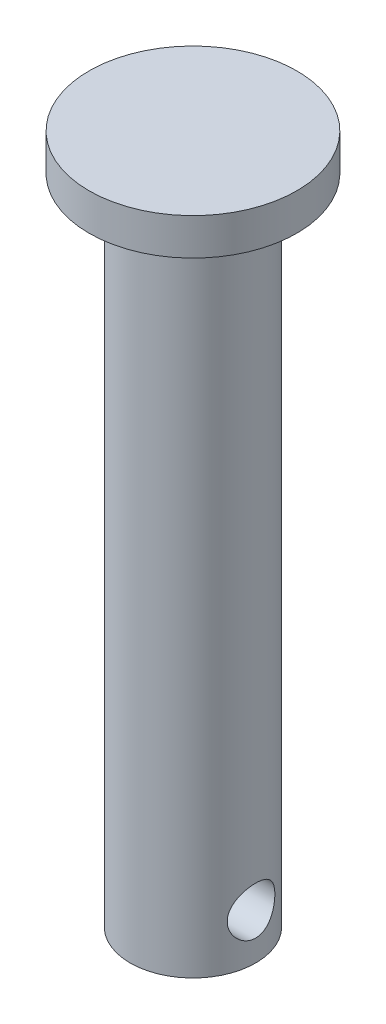
ISO-10303-21;
HEADER;
FILE_DESCRIPTION(('STEP AP214'),'2;1');
FILE_NAME('part.step','',(''),(''),'','','');
FILE_SCHEMA(('AUTOMOTIVE_DESIGN { 1 0 10303 214 1 1 1 1 }'));
ENDSEC;
DATA;
#1=APPLICATION_CONTEXT('core data for automotive mechanical design processes');
#2=APPLICATION_PROTOCOL_DEFINITION('international standard','automotive_design',2000,#1);
#3=PRODUCT_CONTEXT('',#1,'mechanical');
#4=PRODUCT('Part','Part','',(#3));
#5=PRODUCT_RELATED_PRODUCT_CATEGORY('part','',(#4));
#6=PRODUCT_DEFINITION_FORMATION('','',#4);
#7=PRODUCT_DEFINITION_CONTEXT('part definition',#1,'design');
#8=PRODUCT_DEFINITION('design','',#6,#7);
#9=PRODUCT_DEFINITION_SHAPE('','',#8);
#10=(LENGTH_UNIT() NAMED_UNIT(*) SI_UNIT(.MILLI.,.METRE.));
#11=(NAMED_UNIT(*) PLANE_ANGLE_UNIT() SI_UNIT($,.RADIAN.));
#12=(NAMED_UNIT(*) SI_UNIT($,.STERADIAN.) SOLID_ANGLE_UNIT());
#13=UNCERTAINTY_MEASURE_WITH_UNIT(LENGTH_MEASURE(1.E-05),#10,'distance_accuracy_value','');
#14=(GEOMETRIC_REPRESENTATION_CONTEXT(3) GLOBAL_UNCERTAINTY_ASSIGNED_CONTEXT((#13)) GLOBAL_UNIT_ASSIGNED_CONTEXT((#10,
#11,#12)) REPRESENTATION_CONTEXT('',''));
#15=CARTESIAN_POINT('',(0.,0.,0.));
#16=DIRECTION('',(0.,0.,1.));
#17=DIRECTION('',(1.,0.,0.));
#18=AXIS2_PLACEMENT_3D('',#15,#16,#17);
#19=CARTESIAN_POINT('',(0.,-30.15,0.));
#20=DIRECTION('',(0.,1.,0.));
#21=DIRECTION('',(0.,0.,1.));
#22=AXIS2_PLACEMENT_3D('',#19,#20,#21);
#23=CYLINDRICAL_SURFACE('',#22,2.9);
#24=CARTESIAN_POINT('',(-2.68328157299975,-28.05,-1.1));
#25=CARTESIAN_POINT('',(-2.68327922428061,-28.1093489957827,-1.10000248458652));
#26=CARTESIAN_POINT('',(-2.68527194816873,-28.1686818478587,-1.09518093454106));
#27=CARTESIAN_POINT('',(-2.69296977625882,-28.2855554067235,-1.07611268162352));
#28=CARTESIAN_POINT('',(-2.69867470301504,-28.3430961990362,-1.06186642925785));
#29=CARTESIAN_POINT('',(-2.71305970150571,-28.4546639656839,-1.02454933942359));
#30=CARTESIAN_POINT('',(-2.72173249092959,-28.5086991593079,-1.00150008615598));
#31=CARTESIAN_POINT('',(-2.74106414626587,-28.612156903674,-0.947307985473208));
#32=CARTESIAN_POINT('',(-2.75172362287233,-28.661578029053,-0.916162648211992));
#33=CARTESIAN_POINT('',(-2.77443512570219,-28.7569192849796,-0.844965414548746));
#34=CARTESIAN_POINT('',(-2.78652876390518,-28.8025716237422,-0.804568095265991));
#35=CARTESIAN_POINT('',(-2.81039925445747,-28.8866430388596,-0.716746059198641));
#36=CARTESIAN_POINT('',(-2.82217603672252,-28.9250605260548,-0.669319802562992));
#37=CARTESIAN_POINT('',(-2.84458196401774,-28.9948701560771,-0.566745202086737));
#38=CARTESIAN_POINT('',(-2.85515665634353,-29.0259700459012,-0.511384997850494));
#39=CARTESIAN_POINT('',(-2.87346559490726,-29.0783036116571,-0.395746254146733));
#40=CARTESIAN_POINT('',(-2.88120085063207,-29.0995407947278,-0.335469471972143));
#41=CARTESIAN_POINT('',(-2.89266387119534,-29.1306033835331,-0.214524787227563));
#42=CARTESIAN_POINT('',(-2.89655309068144,-29.1408900805804,-0.153990961935245));
#43=CARTESIAN_POINT('',(-2.90046595516458,-29.1512389796451,-0.031939630583864));
#44=CARTESIAN_POINT('',(-2.9004908861957,-29.1513045832395,0.029577541401328));
#45=CARTESIAN_POINT('',(-2.89677431077073,-29.1414754067378,0.14853825001169));
#46=CARTESIAN_POINT('',(-2.89322331838582,-29.1320844439505,0.2060304086711));
#47=CARTESIAN_POINT('',(-2.88300492931398,-29.1044578020864,0.318552502837979));
#48=CARTESIAN_POINT('',(-2.87633731139644,-29.0862214951281,0.373582263250618));
#49=CARTESIAN_POINT('',(-2.86042254178452,-29.0411940177408,0.480576439062401));
#50=CARTESIAN_POINT('',(-2.85113900511872,-29.0142813456148,0.532484085861092));
#51=CARTESIAN_POINT('',(-2.83092877962131,-28.9527736373333,0.63117638536569));
#52=CARTESIAN_POINT('',(-2.82000155459727,-28.9181760925109,0.677959357697908));
#53=CARTESIAN_POINT('',(-2.79685697398916,-28.839866195459,0.768037767468278));
#54=CARTESIAN_POINT('',(-2.7846015436762,-28.795732846916,0.810957985207524));
#55=CARTESIAN_POINT('',(-2.76070055852013,-28.7008255667262,0.88893159880426));
#56=CARTESIAN_POINT('',(-2.74905516483828,-28.6500498925572,0.92398292379018));
#57=CARTESIAN_POINT('',(-2.72744956768312,-28.5417858459963,0.985963844451359));
#58=CARTESIAN_POINT('',(-2.71753465419085,-28.4841692143271,1.01268647609242));
#59=CARTESIAN_POINT('',(-2.70103732259648,-28.3647782244557,1.05590670284941));
#60=CARTESIAN_POINT('',(-2.69445299882884,-28.3030062667863,1.07241014629886));
#61=CARTESIAN_POINT('',(-2.68581406995569,-28.18077260692,1.09386005815007));
#62=CARTESIAN_POINT('',(-2.68352566239426,-28.1204324136924,1.0994039762716));
#63=CARTESIAN_POINT('',(-2.68307507283055,-27.9996537282618,1.10050432818759));
#64=CARTESIAN_POINT('',(-2.68491182496839,-27.9392152654818,1.09606334188405));
#65=CARTESIAN_POINT('',(-2.69226671824544,-27.8230618758687,1.07786206129302));
#66=CARTESIAN_POINT('',(-2.69760001004972,-27.7672606244478,1.06456920532543));
#67=CARTESIAN_POINT('',(-2.7111261186948,-27.6587079715532,1.02963271118627));
#68=CARTESIAN_POINT('',(-2.71931952954047,-27.6059572062758,1.00798733822056));
#69=CARTESIAN_POINT('',(-2.73802573291347,-27.5027702792883,0.956034940410264));
#70=CARTESIAN_POINT('',(-2.74861489819177,-27.4524984964488,0.925429749414474));
#71=CARTESIAN_POINT('',(-2.77079316727057,-27.3575924384407,0.856741568259134));
#72=CARTESIAN_POINT('',(-2.78238264338846,-27.3129602777112,0.818655787024471));
#73=CARTESIAN_POINT('',(-2.80616770118132,-27.2275840747558,0.733153611019962));
#74=CARTESIAN_POINT('',(-2.81835359950513,-27.1872825638096,0.685291082628647));
#75=CARTESIAN_POINT('',(-2.84123732375253,-27.1152276813709,0.583184609426029));
#76=CARTESIAN_POINT('',(-2.85193513643075,-27.0834743859632,0.528940607821527));
#77=CARTESIAN_POINT('',(-2.87063616892688,-27.0296128482981,0.415610983343923));
#78=CARTESIAN_POINT('',(-2.87864733308523,-27.0074761117823,0.356540288773049));
#79=CARTESIAN_POINT('',(-2.89109401464001,-26.9735818843982,0.235139344795649));
#80=CARTESIAN_POINT('',(-2.89553125612603,-26.9618193886506,0.172810682531761));
#81=CARTESIAN_POINT('',(-2.90016328731524,-26.9495564895614,0.050658318150835));
#82=CARTESIAN_POINT('',(-2.90059470016221,-26.9484278829323,-0.00909389404199003));
#83=CARTESIAN_POINT('',(-2.89778717379496,-26.9558416335808,-0.127901157559073));
#84=CARTESIAN_POINT('',(-2.89454869471531,-26.9643827784555,-0.18695629534524));
#85=CARTESIAN_POINT('',(-2.8848750389771,-26.9904508157464,-0.301165868643171));
#86=CARTESIAN_POINT('',(-2.87852321046742,-27.0077437840756,-0.356381298759012));
#87=CARTESIAN_POINT('',(-2.86328858759242,-27.0505895625212,-0.463129089883909));
#88=CARTESIAN_POINT('',(-2.85440531389639,-27.0761439370635,-0.514660751055327));
#89=CARTESIAN_POINT('',(-2.83452467507603,-27.1360198175127,-0.614976465542052));
#90=CARTESIAN_POINT('',(-2.82345355361749,-27.1706675401821,-0.663550913575489));
#91=CARTESIAN_POINT('',(-2.80055278756133,-27.2472363494234,-0.754388675138865));
#92=CARTESIAN_POINT('',(-2.78872287075173,-27.2891600555027,-0.796649705473975));
#93=CARTESIAN_POINT('',(-2.76484922874998,-27.3817954218275,-0.876025383679001));
#94=CARTESIAN_POINT('',(-2.75282876859055,-27.4328606343524,-0.912736027336448));
#95=CARTESIAN_POINT('',(-2.73065635649221,-27.5408138736477,-0.977076367086537));
#96=CARTESIAN_POINT('',(-2.7205046828706,-27.5977027657753,-1.00470471103813));
#97=CARTESIAN_POINT('',(-2.70291934803477,-27.7190113021179,-1.05113434765141));
#98=CARTESIAN_POINT('',(-2.69566125827775,-27.7836714241292,-1.06938090340288));
#99=CARTESIAN_POINT('',(-2.68584535520345,-27.915562494293,-1.09380807528596));
#100=CARTESIAN_POINT('',(-2.68328423275257,-27.9827915984167,-1.0999971863873));
#101=CARTESIAN_POINT('',(-2.68328157299975,-28.05,-1.1));
#102=B_SPLINE_CURVE_WITH_KNOTS('',3,(#24,#25,#26,#27,#28,#29,#30,#31,#32,#33,#34,#35,#36,#37,
#38,#39,#40,#41,#42,#43,#44,#45,#46,#47,#48,#49,#50,#51,#52,#53,#54,#55,#56,#57,#58,#59,#60,#61,
#62,#63,#64,#65,#66,#67,#68,#69,#70,#71,#72,#73,#74,#75,#76,#77,#78,#79,#80,#81,#82,#83,#84,#85,
#86,#87,#88,#89,#90,#91,#92,#93,#94,#95,#96,#97,#98,#99,#100,#101),.UNSPECIFIED.,.T.,.F.,(4,2,2,
2,2,2,2,2,2,2,2,2,2,2,2,2,2,2,2,2,2,2,2,2,2,2,2,2,2,2,2,2,2,2,2,2,2,2,4),(0.,0.177796574464576,
0.355584650760326,0.532939575871951,0.710349108862263,0.895967258544038,1.08162613244064,
1.27376977172793,1.46584503309233,1.64946317987082,1.83302021845158,2.00728945781907,
2.18157106939744,2.35840779424604,2.53530233113083,2.72276283516801,2.91027261586172,
3.10212634980536,3.29387018616065,3.47483657897536,3.65575621902349,3.82780839632731,
3.99989632763184,4.1785304511878,4.35723135177682,4.54757053004695,4.73791140240686,
4.92768437491853,5.1173657444689,5.29576586204596,5.47414361411973,5.64798724425535,
5.821863813687,6.00312410764832,6.18444979501808,6.37562052515605,6.5668197032486,
6.76830333868922,6.96964496914397),.UNSPECIFIED.);
#103=CARTESIAN_POINT('',(-2.68328157299975,-28.05,-1.1));
#104=VERTEX_POINT('',#103);
#105=EDGE_CURVE('E47',#104,#104,#102,.T.);
#106=ORIENTED_EDGE('',*,*,#105,.F.);
#107=EDGE_LOOP('',(#106));
#108=FACE_BOUND('',#107,.T.);
#109=CARTESIAN_POINT('',(2.68328157299975,-28.05,-1.1));
#110=CARTESIAN_POINT('',(2.68327922428061,-27.9906510042173,-1.10000248458652));
#111=CARTESIAN_POINT('',(2.68527194816873,-27.9313181521413,-1.09518093454106));
#112=CARTESIAN_POINT('',(2.69296977625882,-27.8144445932765,-1.07611268162352));
#113=CARTESIAN_POINT('',(2.69867470301504,-27.7569038009638,-1.06186642925785));
#114=CARTESIAN_POINT('',(2.71305970150571,-27.6453360343161,-1.02454933942359));
#115=CARTESIAN_POINT('',(2.72173249092959,-27.5913008406921,-1.00150008615598));
#116=CARTESIAN_POINT('',(2.74106414626587,-27.487843096326,-0.947307985473208));
#117=CARTESIAN_POINT('',(2.75172362287233,-27.438421970947,-0.916162648211992));
#118=CARTESIAN_POINT('',(2.77443512570219,-27.3430807150204,-0.844965414548747));
#119=CARTESIAN_POINT('',(2.78652876390518,-27.2974283762578,-0.804568095265993));
#120=CARTESIAN_POINT('',(2.81039925445747,-27.2133569611404,-0.716746059198644));
#121=CARTESIAN_POINT('',(2.82217603672252,-27.1749394739452,-0.669319802562993));
#122=CARTESIAN_POINT('',(2.84458196401774,-27.1051298439229,-0.566745202086737));
#123=CARTESIAN_POINT('',(2.85515665634353,-27.0740299540988,-0.511384997850494));
#124=CARTESIAN_POINT('',(2.87346559490726,-27.0216963883429,-0.395746254146733));
#125=CARTESIAN_POINT('',(2.88120085063207,-27.0004592052722,-0.335469471972143));
#126=CARTESIAN_POINT('',(2.89266387119534,-26.9693966164669,-0.214524787227563));
#127=CARTESIAN_POINT('',(2.89655309068144,-26.9591099194196,-0.153990961935245));
#128=CARTESIAN_POINT('',(2.90046595516458,-26.9487610203549,-0.0319396305838634));
#129=CARTESIAN_POINT('',(2.9004908861957,-26.9486954167605,0.0295775414013283));
#130=CARTESIAN_POINT('',(2.89677431077073,-26.9585245932622,0.14853825001169));
#131=CARTESIAN_POINT('',(2.89322331838582,-26.9679155560495,0.2060304086711));
#132=CARTESIAN_POINT('',(2.88300492931398,-26.9955421979136,0.318552502837979));
#133=CARTESIAN_POINT('',(2.87633731139644,-27.0137785048719,0.373582263250618));
#134=CARTESIAN_POINT('',(2.86042254178452,-27.0588059822592,0.480576439062401));
#135=CARTESIAN_POINT('',(2.85113900511872,-27.0857186543852,0.532484085861092));
#136=CARTESIAN_POINT('',(2.83092877962131,-27.1472263626667,0.63117638536569));
#137=CARTESIAN_POINT('',(2.82000155459727,-27.1818239074891,0.677959357697908));
#138=CARTESIAN_POINT('',(2.79685697398916,-27.260133804541,0.768037767468278));
#139=CARTESIAN_POINT('',(2.7846015436762,-27.304267153084,0.810957985207524));
#140=CARTESIAN_POINT('',(2.76070055852013,-27.3991744332738,0.88893159880426));
#141=CARTESIAN_POINT('',(2.74905516483828,-27.4499501074428,0.92398292379018));
#142=CARTESIAN_POINT('',(2.72744956768312,-27.5582141540037,0.985963844451359));
#143=CARTESIAN_POINT('',(2.71753465419085,-27.6158307856729,1.01268647609242));
#144=CARTESIAN_POINT('',(2.70103732259648,-27.7352217755443,1.05590670284941));
#145=CARTESIAN_POINT('',(2.69445299882884,-27.7969937332137,1.07241014629886));
#146=CARTESIAN_POINT('',(2.68581406995569,-27.91922739308,1.09386005815007));
#147=CARTESIAN_POINT('',(2.68352566239426,-27.9795675863076,1.0994039762716));
#148=CARTESIAN_POINT('',(2.68307507283055,-28.1003462717382,1.10050432818759));
#149=CARTESIAN_POINT('',(2.68491182496839,-28.1607847345182,1.09606334188405));
#150=CARTESIAN_POINT('',(2.69226671824544,-28.2769381241313,1.07786206129302));
#151=CARTESIAN_POINT('',(2.69760001004972,-28.3327393755522,1.06456920532543));
#152=CARTESIAN_POINT('',(2.71112611869479,-28.4412920284468,1.02963271118627));
#153=CARTESIAN_POINT('',(2.71931952954047,-28.4940427937242,1.00798733822056));
#154=CARTESIAN_POINT('',(2.73802573291347,-28.5972297207117,0.956034940410264));
#155=CARTESIAN_POINT('',(2.74861489819177,-28.6475015035512,0.925429749414474));
#156=CARTESIAN_POINT('',(2.77079316727057,-28.7424075615593,0.856741568259134));
#157=CARTESIAN_POINT('',(2.78238264338846,-28.7870397222888,0.818655787024471));
#158=CARTESIAN_POINT('',(2.80616770118132,-28.8724159252442,0.733153611019962));
#159=CARTESIAN_POINT('',(2.81835359950513,-28.9127174361904,0.685291082628648));
#160=CARTESIAN_POINT('',(2.84123732375253,-28.9847723186291,0.58318460942603));
#161=CARTESIAN_POINT('',(2.85193513643075,-29.0165256140368,0.528940607821528));
#162=CARTESIAN_POINT('',(2.87063616892688,-29.0703871517019,0.415610983343922));
#163=CARTESIAN_POINT('',(2.87864733308523,-29.0925238882177,0.356540288773049));
#164=CARTESIAN_POINT('',(2.89109401464001,-29.1264181156018,0.235139344795648));
#165=CARTESIAN_POINT('',(2.89553125612603,-29.1381806113494,0.172810682531761));
#166=CARTESIAN_POINT('',(2.90016328731524,-29.1504435104386,0.0506583181508351));
#167=CARTESIAN_POINT('',(2.90059470016221,-29.1515721170677,-0.00909389404198984));
#168=CARTESIAN_POINT('',(2.89778717379496,-29.1441583664192,-0.127901157559073));
#169=CARTESIAN_POINT('',(2.89454869471531,-29.1356172215445,-0.18695629534524));
#170=CARTESIAN_POINT('',(2.8848750389771,-29.1095491842536,-0.30116586864317));
#171=CARTESIAN_POINT('',(2.87852321046742,-29.0922562159244,-0.35638129875901));
#172=CARTESIAN_POINT('',(2.86328858759242,-29.0494104374788,-0.463129089883907));
#173=CARTESIAN_POINT('',(2.85440531389639,-29.0238560629365,-0.514660751055326));
#174=CARTESIAN_POINT('',(2.83452467507603,-28.9639801824873,-0.614976465542052));
#175=CARTESIAN_POINT('',(2.82345355361749,-28.9293324598179,-0.663550913575489));
#176=CARTESIAN_POINT('',(2.80055278756133,-28.8527636505766,-0.754388675138865));
#177=CARTESIAN_POINT('',(2.78872287075173,-28.8108399444973,-0.796649705473975));
#178=CARTESIAN_POINT('',(2.76484922874998,-28.7182045781725,-0.876025383679001));
#179=CARTESIAN_POINT('',(2.75282876859055,-28.6671393656476,-0.912736027336448));
#180=CARTESIAN_POINT('',(2.73065635649221,-28.5591861263523,-0.977076367086537));
#181=CARTESIAN_POINT('',(2.7205046828706,-28.5022972342247,-1.00470471103813));
#182=CARTESIAN_POINT('',(2.70291934803477,-28.380988697882,-1.05113434765141));
#183=CARTESIAN_POINT('',(2.69566125827775,-28.3163285758708,-1.06938090340288));
#184=CARTESIAN_POINT('',(2.68584535520345,-28.184437505707,-1.09380807528596));
#185=CARTESIAN_POINT('',(2.68328423275257,-28.1172084015833,-1.0999971863873));
#186=CARTESIAN_POINT('',(2.68328157299975,-28.05,-1.1));
#187=B_SPLINE_CURVE_WITH_KNOTS('',3,(#109,#110,#111,#112,#113,#114,#115,#116,#117,#118,#119,
#120,#121,#122,#123,#124,#125,#126,#127,#128,#129,#130,#131,#132,#133,#134,#135,#136,#137,#138,
#139,#140,#141,#142,#143,#144,#145,#146,#147,#148,#149,#150,#151,#152,#153,#154,#155,#156,#157,
#158,#159,#160,#161,#162,#163,#164,#165,#166,#167,#168,#169,#170,#171,#172,#173,#174,#175,#176,
#177,#178,#179,#180,#181,#182,#183,#184,#185,#186),.UNSPECIFIED.,.T.,.F.,(4,2,2,2,2,2,2,2,2,2,2,
2,2,2,2,2,2,2,2,2,2,2,2,2,2,2,2,2,2,2,2,2,2,2,2,2,2,2,4),(0.,0.177796574464576,
0.355584650760326,0.532939575871951,0.710349108862263,0.895967258544033,1.08162613244064,
1.27376977172793,1.46584503309233,1.64946317987082,1.83302021845158,2.00728945781907,
2.18157106939744,2.35840779424604,2.53530233113083,2.72276283516801,2.91027261586172,
3.10212634980536,3.29387018616065,3.47483657897536,3.65575621902349,3.82780839632731,
3.99989632763184,4.1785304511878,4.35723135177682,4.54757053004695,4.73791140240686,
4.92768437491853,5.1173657444689,5.29576586204596,5.47414361411973,5.64798724425534,
5.821863813687,6.00312410764832,6.18444979501808,6.37562052515605,6.5668197032486,
6.76830333868922,6.96964496914397),.UNSPECIFIED.);
#188=CARTESIAN_POINT('',(2.68328157299975,-28.05,-1.1));
#189=VERTEX_POINT('',#188);
#190=EDGE_CURVE('E65',#189,#189,#187,.T.);
#191=ORIENTED_EDGE('',*,*,#190,.F.);
#192=EDGE_LOOP('',(#191));
#193=FACE_BOUND('',#192,.T.);
#194=CARTESIAN_POINT('',(0.,-30.15,0.));
#195=DIRECTION('',(0.,1.,0.));
#196=DIRECTION('',(0.,0.,1.));
#197=AXIS2_PLACEMENT_3D('',#194,#195,#196);
#198=CIRCLE('',#197,2.9);
#199=CARTESIAN_POINT('',(0.,-30.15,2.9));
#200=VERTEX_POINT('',#199);
#201=EDGE_CURVE('E10',#200,#200,#198,.T.);
#202=ORIENTED_EDGE('',*,*,#201,.T.);
#203=EDGE_LOOP('',(#202));
#204=FACE_BOUND('',#203,.T.);
#205=CARTESIAN_POINT('',(0.,0.,0.));
#206=DIRECTION('',(0.,1.,0.));
#207=DIRECTION('',(0.,0.,1.));
#208=AXIS2_PLACEMENT_3D('',#205,#206,#207);
#209=CIRCLE('',#208,2.9);
#210=CARTESIAN_POINT('',(0.,0.,2.9));
#211=VERTEX_POINT('',#210);
#212=EDGE_CURVE('E55',#211,#211,#209,.T.);
#213=ORIENTED_EDGE('',*,*,#212,.F.);
#214=EDGE_LOOP('',(#213));
#215=FACE_BOUND('',#214,.T.);
#216=ADVANCED_FACE('F43',(#108,#193,#204,#215),#23,.T.);
#217=CARTESIAN_POINT('',(0.,-30.15,0.));
#218=DIRECTION('',(0.,1.,0.));
#219=DIRECTION('',(0.,0.,1.));
#220=AXIS2_PLACEMENT_3D('',#217,#218,#219);
#221=PLANE('',#220);
#222=ORIENTED_EDGE('',*,*,#201,.F.);
#223=EDGE_LOOP('',(#222));
#224=FACE_BOUND('',#223,.T.);
#225=ADVANCED_FACE('F86',(#224),#221,.F.);
#226=CARTESIAN_POINT('',(0.,1.7,0.));
#227=DIRECTION('',(0.,-1.,0.));
#228=DIRECTION('',(0.,0.,-1.));
#229=AXIS2_PLACEMENT_3D('',#226,#227,#228);
#230=CYLINDRICAL_SURFACE('',#229,4.8);
#231=CARTESIAN_POINT('',(0.,1.7,0.));
#232=DIRECTION('',(0.,1.,0.));
#233=DIRECTION('',(0.,0.,1.));
#234=AXIS2_PLACEMENT_3D('',#231,#232,#233);
#235=CIRCLE('',#234,4.8);
#236=CARTESIAN_POINT('',(0.,1.7,4.8));
#237=VERTEX_POINT('',#236);
#238=EDGE_CURVE('E60',#237,#237,#235,.T.);
#239=ORIENTED_EDGE('',*,*,#238,.F.);
#240=EDGE_LOOP('',(#239));
#241=FACE_BOUND('',#240,.T.);
#242=CARTESIAN_POINT('',(0.,0.,0.));
#243=DIRECTION('',(0.,1.,0.));
#244=DIRECTION('',(0.,0.,1.));
#245=AXIS2_PLACEMENT_3D('',#242,#243,#244);
#246=CIRCLE('',#245,4.8);
#247=CARTESIAN_POINT('',(0.,0.,4.8));
#248=VERTEX_POINT('',#247);
#249=EDGE_CURVE('E63',#248,#248,#246,.T.);
#250=ORIENTED_EDGE('',*,*,#249,.T.);
#251=EDGE_LOOP('',(#250));
#252=FACE_BOUND('',#251,.T.);
#253=ADVANCED_FACE('F80',(#241,#252),#230,.T.);
#254=CARTESIAN_POINT('',(0.,1.7,0.));
#255=DIRECTION('',(0.,1.,0.));
#256=DIRECTION('',(0.,0.,1.));
#257=AXIS2_PLACEMENT_3D('',#254,#255,#256);
#258=PLANE('',#257);
#259=ORIENTED_EDGE('',*,*,#238,.T.);
#260=EDGE_LOOP('',(#259));
#261=FACE_BOUND('',#260,.T.);
#262=ADVANCED_FACE('F76',(#261),#258,.T.);
#263=CARTESIAN_POINT('',(0.,0.,0.));
#264=DIRECTION('',(0.,1.,0.));
#265=DIRECTION('',(0.,0.,1.));
#266=AXIS2_PLACEMENT_3D('',#263,#264,#265);
#267=PLANE('',#266);
#268=ORIENTED_EDGE('',*,*,#212,.T.);
#269=EDGE_LOOP('',(#268));
#270=FACE_BOUND('',#269,.T.);
#271=ORIENTED_EDGE('',*,*,#249,.F.);
#272=EDGE_LOOP('',(#271));
#273=FACE_BOUND('',#272,.T.);
#274=ADVANCED_FACE('F74',(#270,#273),#267,.F.);
#275=CARTESIAN_POINT('',(-4.8,-28.05,0.));
#276=DIRECTION('',(1.,0.,0.));
#277=DIRECTION('',(0.,0.,-1.));
#278=AXIS2_PLACEMENT_3D('',#275,#276,#277);
#279=CYLINDRICAL_SURFACE('',#278,1.1);
#280=ORIENTED_EDGE('',*,*,#105,.T.);
#281=EDGE_LOOP('',(#280));
#282=FACE_BOUND('',#281,.T.);
#283=ORIENTED_EDGE('',*,*,#190,.T.);
#284=EDGE_LOOP('',(#283));
#285=FACE_BOUND('',#284,.T.);
#286=ADVANCED_FACE('F70',(#282,#285),#279,.F.);
#287=CLOSED_SHELL('',(#216,#225,#253,#262,#274,#286));
#288=MANIFOLD_SOLID_BREP('B2',#287);
#289=ADVANCED_BREP_SHAPE_REPRESENTATION('',(#18,#288),#14);
#290=SHAPE_DEFINITION_REPRESENTATION(#9,#289);
ENDSEC;
END-ISO-10303-21;
